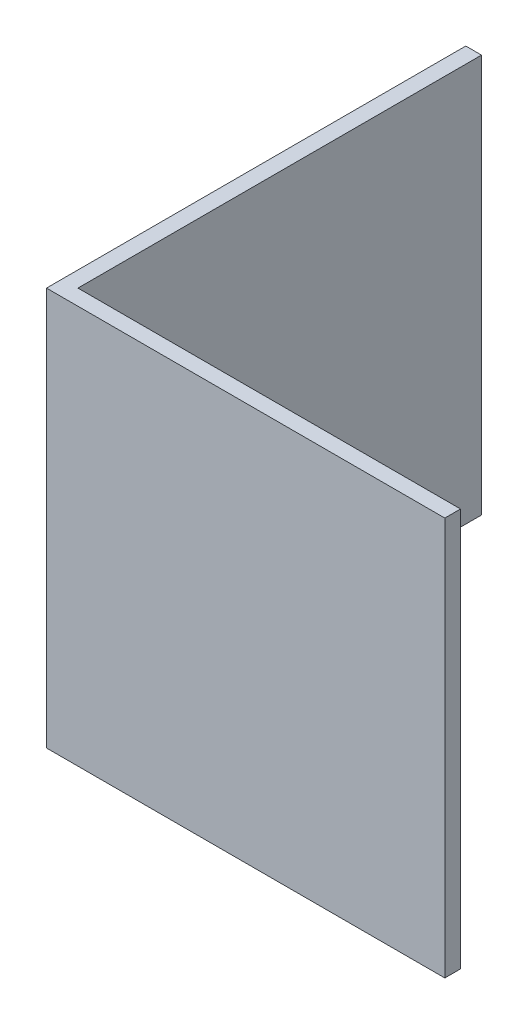
ISO-10303-21;
HEADER;
FILE_DESCRIPTION(('STEP AP214'),'2;1');
FILE_NAME('part.step','',(''),(''),'','','');
FILE_SCHEMA(('AUTOMOTIVE_DESIGN { 1 0 10303 214 1 1 1 1 }'));
ENDSEC;
DATA;
#1=APPLICATION_CONTEXT('core data for automotive mechanical design processes');
#2=APPLICATION_PROTOCOL_DEFINITION('international standard','automotive_design',2000,#1);
#3=PRODUCT_CONTEXT('',#1,'mechanical');
#4=PRODUCT('Part','Part','',(#3));
#5=PRODUCT_RELATED_PRODUCT_CATEGORY('part','',(#4));
#6=PRODUCT_DEFINITION_FORMATION('','',#4);
#7=PRODUCT_DEFINITION_CONTEXT('part definition',#1,'design');
#8=PRODUCT_DEFINITION('design','',#6,#7);
#9=PRODUCT_DEFINITION_SHAPE('','',#8);
#10=(LENGTH_UNIT() NAMED_UNIT(*) SI_UNIT(.MILLI.,.METRE.));
#11=(NAMED_UNIT(*) PLANE_ANGLE_UNIT() SI_UNIT($,.RADIAN.));
#12=(NAMED_UNIT(*) SI_UNIT($,.STERADIAN.) SOLID_ANGLE_UNIT());
#13=UNCERTAINTY_MEASURE_WITH_UNIT(LENGTH_MEASURE(1.E-05),#10,'distance_accuracy_value','');
#14=(GEOMETRIC_REPRESENTATION_CONTEXT(3) GLOBAL_UNCERTAINTY_ASSIGNED_CONTEXT((#13)) GLOBAL_UNIT_ASSIGNED_CONTEXT((#10,
#11,#12)) REPRESENTATION_CONTEXT('',''));
#15=CARTESIAN_POINT('',(0.,0.,0.));
#16=DIRECTION('',(0.,0.,1.));
#17=DIRECTION('',(1.,0.,0.));
#18=AXIS2_PLACEMENT_3D('',#15,#16,#17);
#19=CARTESIAN_POINT('',(20.,19.,0.));
#20=DIRECTION('',(0.,0.,-1.));
#21=DIRECTION('',(-1.,0.,0.));
#22=AXIS2_PLACEMENT_3D('',#19,#20,#21);
#23=PLANE('',#22);
#24=DIRECTION('',(0.,-1.,0.));
#25=VECTOR('',#24,1.);
#26=CARTESIAN_POINT('',(19.,19.,0.));
#27=LINE('',#26,#25);
#28=CARTESIAN_POINT('',(19.,19.,0.));
#29=VERTEX_POINT('',#28);
#30=CARTESIAN_POINT('',(19.,0.,0.));
#31=VERTEX_POINT('',#30);
#32=EDGE_CURVE('E50',#29,#31,#27,.T.);
#33=ORIENTED_EDGE('',*,*,#32,.F.);
#34=DIRECTION('',(1.,0.,0.));
#35=VECTOR('',#34,1.);
#36=CARTESIAN_POINT('',(20.,19.,0.));
#37=LINE('',#36,#35);
#38=CARTESIAN_POINT('',(0.,19.,0.));
#39=VERTEX_POINT('',#38);
#40=EDGE_CURVE('E122',#39,#29,#37,.T.);
#41=ORIENTED_EDGE('',*,*,#40,.F.);
#42=DIRECTION('',(0.,-1.,0.));
#43=VECTOR('',#42,1.);
#44=CARTESIAN_POINT('',(0.,19.,0.));
#45=LINE('',#44,#43);
#46=CARTESIAN_POINT('',(0.,0.,0.));
#47=VERTEX_POINT('',#46);
#48=EDGE_CURVE('E123',#39,#47,#45,.T.);
#49=ORIENTED_EDGE('',*,*,#48,.T.);
#50=DIRECTION('',(1.,0.,0.));
#51=VECTOR('',#50,1.);
#52=CARTESIAN_POINT('',(20.,0.,0.));
#53=LINE('',#52,#51);
#54=EDGE_CURVE('E113',#47,#31,#53,.T.);
#55=ORIENTED_EDGE('',*,*,#54,.T.);
#56=EDGE_LOOP('',(#33,#41,#49,#55));
#57=FACE_BOUND('',#56,.T.);
#58=ADVANCED_FACE('F36',(#57),#23,.F.);
#59=CARTESIAN_POINT('',(0.749999999999998,19.,-0.749999999999998));
#60=DIRECTION('',(0.,0.,1.));
#61=DIRECTION('',(1.,0.,0.));
#62=AXIS2_PLACEMENT_3D('',#59,#60,#61);
#63=PLANE('',#62);
#64=DIRECTION('',(0.,1.,0.));
#65=VECTOR('',#64,1.);
#66=CARTESIAN_POINT('',(19.,0.,-0.75));
#67=LINE('',#66,#65);
#68=CARTESIAN_POINT('',(19.,0.,-0.75));
#69=VERTEX_POINT('',#68);
#70=CARTESIAN_POINT('',(19.,19.,-0.75));
#71=VERTEX_POINT('',#70);
#72=EDGE_CURVE('E98',#69,#71,#67,.T.);
#73=ORIENTED_EDGE('',*,*,#72,.F.);
#74=DIRECTION('',(-1.,0.,0.));
#75=VECTOR('',#74,1.);
#76=CARTESIAN_POINT('',(0.749999999999998,0.,-0.749999999999998));
#77=LINE('',#76,#75);
#78=CARTESIAN_POINT('',(0.749999999999998,0.,-0.749999999999998));
#79=VERTEX_POINT('',#78);
#80=EDGE_CURVE('E106',#69,#79,#77,.T.);
#81=ORIENTED_EDGE('',*,*,#80,.T.);
#82=DIRECTION('',(0.,-1.,0.));
#83=VECTOR('',#82,1.);
#84=CARTESIAN_POINT('',(0.749999999999998,19.,-0.749999999999998));
#85=LINE('',#84,#83);
#86=CARTESIAN_POINT('',(0.749999999999998,19.,-0.749999999999998));
#87=VERTEX_POINT('',#86);
#88=EDGE_CURVE('E11',#87,#79,#85,.T.);
#89=ORIENTED_EDGE('',*,*,#88,.F.);
#90=DIRECTION('',(-1.,0.,0.));
#91=VECTOR('',#90,1.);
#92=CARTESIAN_POINT('',(0.749999999999998,19.,-0.749999999999998));
#93=LINE('',#92,#91);
#94=EDGE_CURVE('E87',#71,#87,#93,.T.);
#95=ORIENTED_EDGE('',*,*,#94,.F.);
#96=EDGE_LOOP('',(#73,#81,#89,#95));
#97=FACE_BOUND('',#96,.T.);
#98=ADVANCED_FACE('F105',(#97),#63,.F.);
#99=CARTESIAN_POINT('',(0.,19.,0.));
#100=DIRECTION('',(0.,-1.,0.));
#101=DIRECTION('',(0.,0.,-1.));
#102=AXIS2_PLACEMENT_3D('',#99,#100,#101);
#103=PLANE('',#102);
#104=DIRECTION('',(0.,0.,1.));
#105=VECTOR('',#104,1.);
#106=CARTESIAN_POINT('',(19.,19.,-0.75));
#107=LINE('',#106,#105);
#108=EDGE_CURVE('E107',#71,#29,#107,.T.);
#109=ORIENTED_EDGE('',*,*,#108,.F.);
#110=ORIENTED_EDGE('',*,*,#94,.T.);
#111=DIRECTION('',(0.,0.,-1.));
#112=VECTOR('',#111,1.);
#113=CARTESIAN_POINT('',(0.749999999999998,19.,-20.));
#114=LINE('',#113,#112);
#115=CARTESIAN_POINT('',(0.749999999999998,19.,-20.));
#116=VERTEX_POINT('',#115);
#117=EDGE_CURVE('E138',#87,#116,#114,.T.);
#118=ORIENTED_EDGE('',*,*,#117,.T.);
#119=DIRECTION('',(-1.,0.,0.));
#120=VECTOR('',#119,1.);
#121=CARTESIAN_POINT('',(0.,19.,-20.));
#122=LINE('',#121,#120);
#123=CARTESIAN_POINT('',(0.,19.,-20.));
#124=VERTEX_POINT('',#123);
#125=EDGE_CURVE('E132',#116,#124,#122,.T.);
#126=ORIENTED_EDGE('',*,*,#125,.T.);
#127=DIRECTION('',(0.,0.,1.));
#128=VECTOR('',#127,1.);
#129=CARTESIAN_POINT('',(0.,19.,0.));
#130=LINE('',#129,#128);
#131=EDGE_CURVE('E59',#124,#39,#130,.T.);
#132=ORIENTED_EDGE('',*,*,#131,.T.);
#133=ORIENTED_EDGE('',*,*,#40,.T.);
#134=EDGE_LOOP('',(#109,#110,#118,#126,#132,#133));
#135=FACE_BOUND('',#134,.T.);
#136=ADVANCED_FACE('F145',(#135),#103,.F.);
#137=CARTESIAN_POINT('',(0.,0.,0.));
#138=DIRECTION('',(0.,-1.,0.));
#139=DIRECTION('',(0.,0.,-1.));
#140=AXIS2_PLACEMENT_3D('',#137,#138,#139);
#141=PLANE('',#140);
#142=ORIENTED_EDGE('',*,*,#80,.F.);
#143=DIRECTION('',(0.,0.,-1.));
#144=VECTOR('',#143,1.);
#145=CARTESIAN_POINT('',(19.,0.,0.));
#146=LINE('',#145,#144);
#147=EDGE_CURVE('E95',#31,#69,#146,.T.);
#148=ORIENTED_EDGE('',*,*,#147,.F.);
#149=ORIENTED_EDGE('',*,*,#54,.F.);
#150=DIRECTION('',(0.,0.,1.));
#151=VECTOR('',#150,1.);
#152=CARTESIAN_POINT('',(0.,0.,0.));
#153=LINE('',#152,#151);
#154=CARTESIAN_POINT('',(0.,0.,-20.));
#155=VERTEX_POINT('',#154);
#156=EDGE_CURVE('E80',#155,#47,#153,.T.);
#157=ORIENTED_EDGE('',*,*,#156,.F.);
#158=DIRECTION('',(-1.,0.,0.));
#159=VECTOR('',#158,1.);
#160=CARTESIAN_POINT('',(0.,0.,-20.));
#161=LINE('',#160,#159);
#162=CARTESIAN_POINT('',(0.749999999999998,0.,-20.));
#163=VERTEX_POINT('',#162);
#164=EDGE_CURVE('E115',#163,#155,#161,.T.);
#165=ORIENTED_EDGE('',*,*,#164,.F.);
#166=DIRECTION('',(0.,0.,-1.));
#167=VECTOR('',#166,1.);
#168=CARTESIAN_POINT('',(0.749999999999998,0.,-20.));
#169=LINE('',#168,#167);
#170=EDGE_CURVE('E112',#79,#163,#169,.T.);
#171=ORIENTED_EDGE('',*,*,#170,.F.);
#172=EDGE_LOOP('',(#142,#148,#149,#157,#165,#171));
#173=FACE_BOUND('',#172,.T.);
#174=ADVANCED_FACE('F110',(#173),#141,.T.);
#175=CARTESIAN_POINT('',(0.749999999999998,19.,-20.));
#176=DIRECTION('',(-1.,0.,0.));
#177=DIRECTION('',(0.,0.,1.));
#178=AXIS2_PLACEMENT_3D('',#175,#176,#177);
#179=PLANE('',#178);
#180=ORIENTED_EDGE('',*,*,#170,.T.);
#181=DIRECTION('',(0.,-1.,0.));
#182=VECTOR('',#181,1.);
#183=CARTESIAN_POINT('',(0.749999999999998,19.,-20.));
#184=LINE('',#183,#182);
#185=EDGE_CURVE('E43',#116,#163,#184,.T.);
#186=ORIENTED_EDGE('',*,*,#185,.F.);
#187=ORIENTED_EDGE('',*,*,#117,.F.);
#188=ORIENTED_EDGE('',*,*,#88,.T.);
#189=EDGE_LOOP('',(#180,#186,#187,#188));
#190=FACE_BOUND('',#189,.T.);
#191=ADVANCED_FACE('F152',(#190),#179,.F.);
#192=CARTESIAN_POINT('',(0.,19.,-20.));
#193=DIRECTION('',(0.,0.,1.));
#194=DIRECTION('',(1.,0.,0.));
#195=AXIS2_PLACEMENT_3D('',#192,#193,#194);
#196=PLANE('',#195);
#197=ORIENTED_EDGE('',*,*,#164,.T.);
#198=DIRECTION('',(0.,-1.,0.));
#199=VECTOR('',#198,1.);
#200=CARTESIAN_POINT('',(0.,19.,-20.));
#201=LINE('',#200,#199);
#202=EDGE_CURVE('E125',#124,#155,#201,.T.);
#203=ORIENTED_EDGE('',*,*,#202,.F.);
#204=ORIENTED_EDGE('',*,*,#125,.F.);
#205=ORIENTED_EDGE('',*,*,#185,.T.);
#206=EDGE_LOOP('',(#197,#203,#204,#205));
#207=FACE_BOUND('',#206,.T.);
#208=ADVANCED_FACE('F130',(#207),#196,.F.);
#209=CARTESIAN_POINT('',(0.,19.,0.));
#210=DIRECTION('',(1.,0.,0.));
#211=DIRECTION('',(0.,0.,-1.));
#212=AXIS2_PLACEMENT_3D('',#209,#210,#211);
#213=PLANE('',#212);
#214=ORIENTED_EDGE('',*,*,#156,.T.);
#215=ORIENTED_EDGE('',*,*,#48,.F.);
#216=ORIENTED_EDGE('',*,*,#131,.F.);
#217=ORIENTED_EDGE('',*,*,#202,.T.);
#218=EDGE_LOOP('',(#214,#215,#216,#217));
#219=FACE_BOUND('',#218,.T.);
#220=ADVANCED_FACE('F137',(#219),#213,.F.);
#221=CARTESIAN_POINT('',(19.,0.,0.));
#222=DIRECTION('',(1.,0.,0.));
#223=DIRECTION('',(0.,0.,-1.));
#224=AXIS2_PLACEMENT_3D('',#221,#222,#223);
#225=PLANE('',#224);
#226=ORIENTED_EDGE('',*,*,#32,.T.);
#227=ORIENTED_EDGE('',*,*,#147,.T.);
#228=ORIENTED_EDGE('',*,*,#72,.T.);
#229=ORIENTED_EDGE('',*,*,#108,.T.);
#230=EDGE_LOOP('',(#226,#227,#228,#229));
#231=FACE_BOUND('',#230,.T.);
#232=ADVANCED_FACE('F97',(#231),#225,.T.);
#233=CLOSED_SHELL('',(#58,#98,#136,#174,#191,#208,#220,#232));
#234=MANIFOLD_SOLID_BREP('B2',#233);
#235=ADVANCED_BREP_SHAPE_REPRESENTATION('',(#18,#234),#14);
#236=SHAPE_DEFINITION_REPRESENTATION(#9,#235);
ENDSEC;
END-ISO-10303-21;
